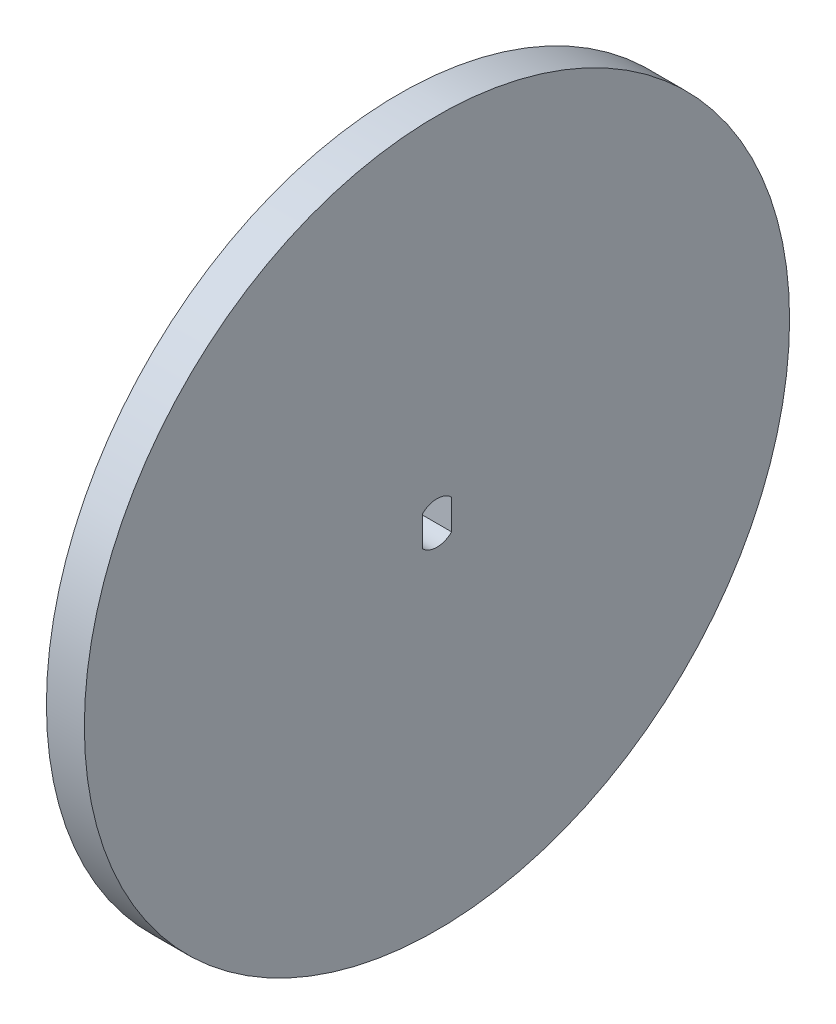
ISO-10303-21;
HEADER;
FILE_DESCRIPTION(('STEP AP214'),'2;1');
FILE_NAME('part.step','',(''),(''),'','','');
FILE_SCHEMA(('AUTOMOTIVE_DESIGN { 1 0 10303 214 1 1 1 1 }'));
ENDSEC;
DATA;
#1=APPLICATION_CONTEXT('core data for automotive mechanical design processes');
#2=APPLICATION_PROTOCOL_DEFINITION('international standard','automotive_design',2000,#1);
#3=PRODUCT_CONTEXT('',#1,'mechanical');
#4=PRODUCT('Part','Part','',(#3));
#5=PRODUCT_RELATED_PRODUCT_CATEGORY('part','',(#4));
#6=PRODUCT_DEFINITION_FORMATION('','',#4);
#7=PRODUCT_DEFINITION_CONTEXT('part definition',#1,'design');
#8=PRODUCT_DEFINITION('design','',#6,#7);
#9=PRODUCT_DEFINITION_SHAPE('','',#8);
#10=(LENGTH_UNIT() NAMED_UNIT(*) SI_UNIT(.MILLI.,.METRE.));
#11=(NAMED_UNIT(*) PLANE_ANGLE_UNIT() SI_UNIT($,.RADIAN.));
#12=(NAMED_UNIT(*) SI_UNIT($,.STERADIAN.) SOLID_ANGLE_UNIT());
#13=UNCERTAINTY_MEASURE_WITH_UNIT(LENGTH_MEASURE(1.E-05),#10,'distance_accuracy_value','');
#14=(GEOMETRIC_REPRESENTATION_CONTEXT(3) GLOBAL_UNCERTAINTY_ASSIGNED_CONTEXT((#13)) GLOBAL_UNIT_ASSIGNED_CONTEXT((#10,
#11,#12)) REPRESENTATION_CONTEXT('',''));
#15=CARTESIAN_POINT('',(0.,0.,0.));
#16=DIRECTION('',(0.,0.,1.));
#17=DIRECTION('',(1.,0.,0.));
#18=AXIS2_PLACEMENT_3D('',#15,#16,#17);
#19=CARTESIAN_POINT('',(4.84,0.,0.));
#20=DIRECTION('',(1.,0.,0.));
#21=DIRECTION('',(0.,0.,-1.));
#22=AXIS2_PLACEMENT_3D('',#19,#20,#21);
#23=PLANE('',#22);
#24=CARTESIAN_POINT('',(4.84,0.,0.));
#25=DIRECTION('',(1.,0.,0.));
#26=DIRECTION('',(0.,0.,-1.));
#27=AXIS2_PLACEMENT_3D('',#24,#25,#26);
#28=CIRCLE('',#27,45.);
#29=CARTESIAN_POINT('',(4.84,0.,-45.));
#30=VERTEX_POINT('',#29);
#31=EDGE_CURVE('E11',#30,#30,#28,.T.);
#32=ORIENTED_EDGE('',*,*,#31,.T.);
#33=EDGE_LOOP('',(#32));
#34=FACE_BOUND('',#33,.T.);
#35=DIRECTION('',(0.,-1.,0.));
#36=VECTOR('',#35,1.);
#37=CARTESIAN_POINT('',(4.84,1.91976561069314,1.87));
#38=LINE('',#37,#36);
#39=CARTESIAN_POINT('',(4.84,1.91976561069314,1.87));
#40=VERTEX_POINT('',#39);
#41=CARTESIAN_POINT('',(4.84,-1.91976561069314,1.87));
#42=VERTEX_POINT('',#41);
#43=EDGE_CURVE('E83',#40,#42,#38,.T.);
#44=ORIENTED_EDGE('',*,*,#43,.F.);
#45=CARTESIAN_POINT('',(4.84,0.,0.));
#46=DIRECTION('',(1.,0.,0.));
#47=DIRECTION('',(0.,0.,-1.));
#48=AXIS2_PLACEMENT_3D('',#45,#46,#47);
#49=CIRCLE('',#48,2.68);
#50=CARTESIAN_POINT('',(4.84,1.91976561069314,-1.87));
#51=VERTEX_POINT('',#50);
#52=EDGE_CURVE('E75',#51,#40,#49,.T.);
#53=ORIENTED_EDGE('',*,*,#52,.F.);
#54=DIRECTION('',(0.,1.,0.));
#55=VECTOR('',#54,1.);
#56=CARTESIAN_POINT('',(4.84,1.91976561069314,-1.87));
#57=LINE('',#56,#55);
#58=CARTESIAN_POINT('',(4.84,-1.91976561069314,-1.87));
#59=VERTEX_POINT('',#58);
#60=EDGE_CURVE('E96',#59,#51,#57,.T.);
#61=ORIENTED_EDGE('',*,*,#60,.F.);
#62=CARTESIAN_POINT('',(4.84,0.,0.));
#63=DIRECTION('',(1.,0.,0.));
#64=DIRECTION('',(0.,0.,-1.));
#65=AXIS2_PLACEMENT_3D('',#62,#63,#64);
#66=CIRCLE('',#65,2.68);
#67=EDGE_CURVE('E94',#42,#59,#66,.T.);
#68=ORIENTED_EDGE('',*,*,#67,.F.);
#69=EDGE_LOOP('',(#44,#53,#61,#68));
#70=FACE_BOUND('',#69,.T.);
#71=ADVANCED_FACE('F34',(#34,#70),#23,.T.);
#72=CARTESIAN_POINT('',(0.,0.,0.));
#73=DIRECTION('',(1.,0.,0.));
#74=DIRECTION('',(0.,0.,-1.));
#75=AXIS2_PLACEMENT_3D('',#72,#73,#74);
#76=PLANE('',#75);
#77=CARTESIAN_POINT('',(0.,0.,0.));
#78=DIRECTION('',(1.,0.,0.));
#79=DIRECTION('',(0.,0.,-1.));
#80=AXIS2_PLACEMENT_3D('',#77,#78,#79);
#81=CIRCLE('',#80,45.);
#82=CARTESIAN_POINT('',(0.,0.,-45.));
#83=VERTEX_POINT('',#82);
#84=EDGE_CURVE('E38',#83,#83,#81,.T.);
#85=ORIENTED_EDGE('',*,*,#84,.F.);
#86=EDGE_LOOP('',(#85));
#87=FACE_BOUND('',#86,.T.);
#88=CARTESIAN_POINT('',(0.,0.,0.));
#89=DIRECTION('',(1.,0.,0.));
#90=DIRECTION('',(0.,0.,-1.));
#91=AXIS2_PLACEMENT_3D('',#88,#89,#90);
#92=CIRCLE('',#91,2.68);
#93=CARTESIAN_POINT('',(0.,1.91976561069314,-1.87));
#94=VERTEX_POINT('',#93);
#95=CARTESIAN_POINT('',(0.,1.91976561069314,1.87));
#96=VERTEX_POINT('',#95);
#97=EDGE_CURVE('E57',#94,#96,#92,.T.);
#98=ORIENTED_EDGE('',*,*,#97,.T.);
#99=DIRECTION('',(0.,-1.,0.));
#100=VECTOR('',#99,1.);
#101=CARTESIAN_POINT('',(0.,1.91976561069314,1.87));
#102=LINE('',#101,#100);
#103=CARTESIAN_POINT('',(0.,-1.91976561069314,1.87));
#104=VERTEX_POINT('',#103);
#105=EDGE_CURVE('E90',#96,#104,#102,.T.);
#106=ORIENTED_EDGE('',*,*,#105,.T.);
#107=CARTESIAN_POINT('',(0.,0.,0.));
#108=DIRECTION('',(1.,0.,0.));
#109=DIRECTION('',(0.,0.,-1.));
#110=AXIS2_PLACEMENT_3D('',#107,#108,#109);
#111=CIRCLE('',#110,2.68);
#112=CARTESIAN_POINT('',(0.,-1.91976561069314,-1.87));
#113=VERTEX_POINT('',#112);
#114=EDGE_CURVE('E102',#104,#113,#111,.T.);
#115=ORIENTED_EDGE('',*,*,#114,.T.);
#116=DIRECTION('',(0.,1.,0.));
#117=VECTOR('',#116,1.);
#118=CARTESIAN_POINT('',(0.,1.91976561069314,-1.87));
#119=LINE('',#118,#117);
#120=EDGE_CURVE('E84',#113,#94,#119,.T.);
#121=ORIENTED_EDGE('',*,*,#120,.T.);
#122=EDGE_LOOP('',(#98,#106,#115,#121));
#123=FACE_BOUND('',#122,.T.);
#124=ADVANCED_FACE('F113',(#87,#123),#76,.F.);
#125=CARTESIAN_POINT('',(4.84,0.,0.));
#126=DIRECTION('',(-1.,0.,0.));
#127=DIRECTION('',(0.,0.,1.));
#128=AXIS2_PLACEMENT_3D('',#125,#126,#127);
#129=CYLINDRICAL_SURFACE('',#128,45.);
#130=ORIENTED_EDGE('',*,*,#31,.F.);
#131=EDGE_LOOP('',(#130));
#132=FACE_BOUND('',#131,.T.);
#133=ORIENTED_EDGE('',*,*,#84,.T.);
#134=EDGE_LOOP('',(#133));
#135=FACE_BOUND('',#134,.T.);
#136=ADVANCED_FACE('F36',(#132,#135),#129,.T.);
#137=CARTESIAN_POINT('',(4.84,0.,0.));
#138=DIRECTION('',(-1.,0.,0.));
#139=DIRECTION('',(0.,0.,1.));
#140=AXIS2_PLACEMENT_3D('',#137,#138,#139);
#141=CYLINDRICAL_SURFACE('',#140,2.68);
#142=ORIENTED_EDGE('',*,*,#97,.F.);
#143=DIRECTION('',(-1.,0.,0.));
#144=VECTOR('',#143,1.);
#145=CARTESIAN_POINT('',(4.84,1.91976561069314,-1.87));
#146=LINE('',#145,#144);
#147=EDGE_CURVE('E79',#51,#94,#146,.T.);
#148=ORIENTED_EDGE('',*,*,#147,.F.);
#149=ORIENTED_EDGE('',*,*,#52,.T.);
#150=DIRECTION('',(-1.,0.,0.));
#151=VECTOR('',#150,1.);
#152=CARTESIAN_POINT('',(4.84,1.91976561069314,1.87));
#153=LINE('',#152,#151);
#154=EDGE_CURVE('E78',#40,#96,#153,.T.);
#155=ORIENTED_EDGE('',*,*,#154,.T.);
#156=EDGE_LOOP('',(#142,#148,#149,#155));
#157=FACE_BOUND('',#156,.T.);
#158=ADVANCED_FACE('F77',(#157),#141,.F.);
#159=CARTESIAN_POINT('',(4.84,1.91976561069314,1.87));
#160=DIRECTION('',(0.,0.,-1.));
#161=DIRECTION('',(-1.,0.,0.));
#162=AXIS2_PLACEMENT_3D('',#159,#160,#161);
#163=PLANE('',#162);
#164=ORIENTED_EDGE('',*,*,#105,.F.);
#165=ORIENTED_EDGE('',*,*,#154,.F.);
#166=ORIENTED_EDGE('',*,*,#43,.T.);
#167=DIRECTION('',(-1.,0.,0.));
#168=VECTOR('',#167,1.);
#169=CARTESIAN_POINT('',(4.84,-1.91976561069314,1.87));
#170=LINE('',#169,#168);
#171=EDGE_CURVE('E91',#42,#104,#170,.T.);
#172=ORIENTED_EDGE('',*,*,#171,.T.);
#173=EDGE_LOOP('',(#164,#165,#166,#172));
#174=FACE_BOUND('',#173,.T.);
#175=ADVANCED_FACE('F87',(#174),#163,.T.);
#176=CARTESIAN_POINT('',(4.84,0.,0.));
#177=DIRECTION('',(-1.,0.,0.));
#178=DIRECTION('',(0.,0.,1.));
#179=AXIS2_PLACEMENT_3D('',#176,#177,#178);
#180=CYLINDRICAL_SURFACE('',#179,2.68);
#181=ORIENTED_EDGE('',*,*,#114,.F.);
#182=ORIENTED_EDGE('',*,*,#171,.F.);
#183=ORIENTED_EDGE('',*,*,#67,.T.);
#184=DIRECTION('',(-1.,0.,0.));
#185=VECTOR('',#184,1.);
#186=CARTESIAN_POINT('',(4.84,-1.91976561069314,-1.87));
#187=LINE('',#186,#185);
#188=EDGE_CURVE('E49',#59,#113,#187,.T.);
#189=ORIENTED_EDGE('',*,*,#188,.T.);
#190=EDGE_LOOP('',(#181,#182,#183,#189));
#191=FACE_BOUND('',#190,.T.);
#192=ADVANCED_FACE('F111',(#191),#180,.F.);
#193=CARTESIAN_POINT('',(4.84,1.91976561069314,-1.87));
#194=DIRECTION('',(0.,0.,1.));
#195=DIRECTION('',(1.,0.,0.));
#196=AXIS2_PLACEMENT_3D('',#193,#194,#195);
#197=PLANE('',#196);
#198=ORIENTED_EDGE('',*,*,#120,.F.);
#199=ORIENTED_EDGE('',*,*,#188,.F.);
#200=ORIENTED_EDGE('',*,*,#60,.T.);
#201=ORIENTED_EDGE('',*,*,#147,.T.);
#202=EDGE_LOOP('',(#198,#199,#200,#201));
#203=FACE_BOUND('',#202,.T.);
#204=ADVANCED_FACE('F114',(#203),#197,.T.);
#205=CLOSED_SHELL('',(#71,#124,#136,#158,#175,#192,#204));
#206=MANIFOLD_SOLID_BREP('B2',#205);
#207=ADVANCED_BREP_SHAPE_REPRESENTATION('',(#18,#206),#14);
#208=SHAPE_DEFINITION_REPRESENTATION(#9,#207);
ENDSEC;
END-ISO-10303-21;
